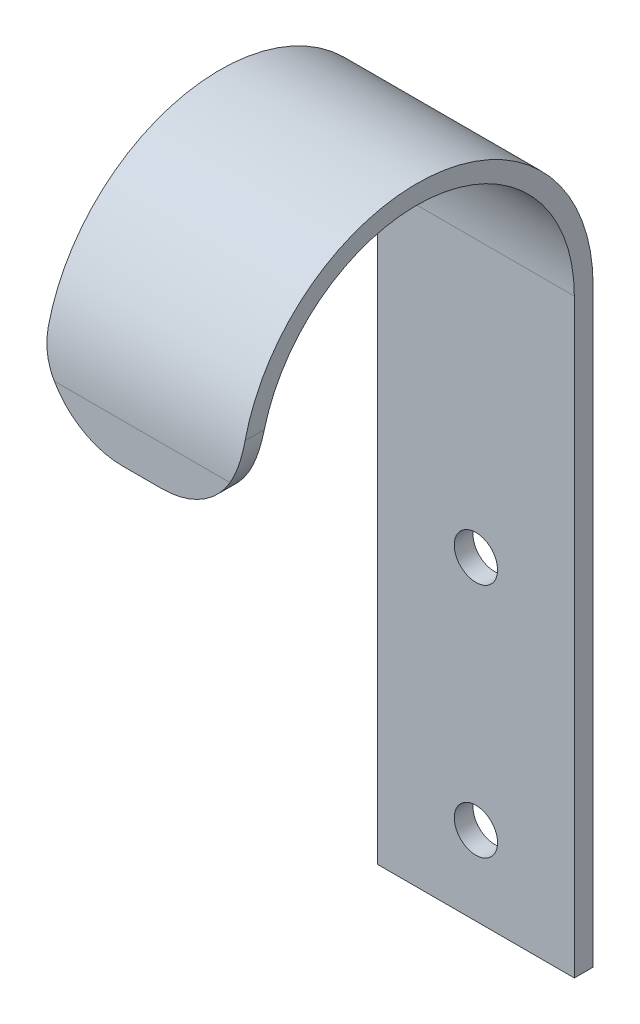
ISO-10303-21;
HEADER;
FILE_DESCRIPTION(('STEP AP214'),'2;1');
FILE_NAME('part.step','',(''),(''),'','','');
FILE_SCHEMA(('AUTOMOTIVE_DESIGN { 1 0 10303 214 1 1 1 1 }'));
ENDSEC;
DATA;
#1=APPLICATION_CONTEXT('core data for automotive mechanical design processes');
#2=APPLICATION_PROTOCOL_DEFINITION('international standard','automotive_design',2000,#1);
#3=PRODUCT_CONTEXT('',#1,'mechanical');
#4=PRODUCT('Part','Part','',(#3));
#5=PRODUCT_RELATED_PRODUCT_CATEGORY('part','',(#4));
#6=PRODUCT_DEFINITION_FORMATION('','',#4);
#7=PRODUCT_DEFINITION_CONTEXT('part definition',#1,'design');
#8=PRODUCT_DEFINITION('design','',#6,#7);
#9=PRODUCT_DEFINITION_SHAPE('','',#8);
#10=(LENGTH_UNIT() NAMED_UNIT(*) SI_UNIT(.MILLI.,.METRE.));
#11=(NAMED_UNIT(*) PLANE_ANGLE_UNIT() SI_UNIT($,.RADIAN.));
#12=(NAMED_UNIT(*) SI_UNIT($,.STERADIAN.) SOLID_ANGLE_UNIT());
#13=UNCERTAINTY_MEASURE_WITH_UNIT(LENGTH_MEASURE(1.E-05),#10,'distance_accuracy_value','');
#14=(GEOMETRIC_REPRESENTATION_CONTEXT(3) GLOBAL_UNCERTAINTY_ASSIGNED_CONTEXT((#13)) GLOBAL_UNIT_ASSIGNED_CONTEXT((#10,
#11,#12)) REPRESENTATION_CONTEXT('',''));
#15=CARTESIAN_POINT('',(0.,0.,0.));
#16=DIRECTION('',(0.,0.,1.));
#17=DIRECTION('',(1.,0.,0.));
#18=AXIS2_PLACEMENT_3D('',#15,#16,#17);
#19=CARTESIAN_POINT('',(25.,0.,0.));
#20=DIRECTION('',(0.,0.,1.));
#21=DIRECTION('',(1.,0.,0.));
#22=AXIS2_PLACEMENT_3D('',#19,#20,#21);
#23=PLANE('',#22);
#24=CARTESIAN_POINT('',(12.5,10.,0.));
#25=DIRECTION('',(0.,0.,1.));
#26=DIRECTION('',(1.,0.,0.));
#27=AXIS2_PLACEMENT_3D('',#24,#25,#26);
#28=CIRCLE('',#27,2.75);
#29=CARTESIAN_POINT('',(15.25,10.,0.));
#30=VERTEX_POINT('',#29);
#31=EDGE_CURVE('E246',#30,#30,#28,.T.);
#32=ORIENTED_EDGE('',*,*,#31,.F.);
#33=EDGE_LOOP('',(#32));
#34=FACE_BOUND('',#33,.T.);
#35=CARTESIAN_POINT('',(12.5,40.,0.));
#36=DIRECTION('',(0.,0.,1.));
#37=DIRECTION('',(1.,0.,0.));
#38=AXIS2_PLACEMENT_3D('',#35,#36,#37);
#39=CIRCLE('',#38,2.75);
#40=CARTESIAN_POINT('',(15.25,40.,0.));
#41=VERTEX_POINT('',#40);
#42=EDGE_CURVE('E141',#41,#41,#39,.T.);
#43=ORIENTED_EDGE('',*,*,#42,.F.);
#44=EDGE_LOOP('',(#43));
#45=FACE_BOUND('',#44,.T.);
#46=DIRECTION('',(0.,1.,0.));
#47=VECTOR('',#46,1.);
#48=CARTESIAN_POINT('',(0.,0.,0.));
#49=LINE('',#48,#47);
#50=CARTESIAN_POINT('',(0.,0.,0.));
#51=VERTEX_POINT('',#50);
#52=CARTESIAN_POINT('',(0.,75.,0.));
#53=VERTEX_POINT('',#52);
#54=EDGE_CURVE('E148',#51,#53,#49,.T.);
#55=ORIENTED_EDGE('',*,*,#54,.F.);
#56=DIRECTION('',(-1.,0.,0.));
#57=VECTOR('',#56,1.);
#58=CARTESIAN_POINT('',(25.,0.,0.));
#59=LINE('',#58,#57);
#60=CARTESIAN_POINT('',(25.,0.,0.));
#61=VERTEX_POINT('',#60);
#62=EDGE_CURVE('E134',#61,#51,#59,.T.);
#63=ORIENTED_EDGE('',*,*,#62,.F.);
#64=DIRECTION('',(0.,1.,0.));
#65=VECTOR('',#64,1.);
#66=CARTESIAN_POINT('',(25.,0.,0.));
#67=LINE('',#66,#65);
#68=CARTESIAN_POINT('',(25.,75.,0.));
#69=VERTEX_POINT('',#68);
#70=EDGE_CURVE('E130',#61,#69,#67,.T.);
#71=ORIENTED_EDGE('',*,*,#70,.T.);
#72=DIRECTION('',(-1.,0.,0.));
#73=VECTOR('',#72,1.);
#74=CARTESIAN_POINT('',(25.,75.,0.));
#75=LINE('',#74,#73);
#76=EDGE_CURVE('E114',#69,#53,#75,.T.);
#77=ORIENTED_EDGE('',*,*,#76,.T.);
#78=EDGE_LOOP('',(#55,#63,#71,#77));
#79=FACE_BOUND('',#78,.T.);
#80=ADVANCED_FACE('F33',(#34,#45,#79),#23,.T.);
#81=CARTESIAN_POINT('',(25.,0.,-2.38));
#82=DIRECTION('',(0.,-1.,0.));
#83=DIRECTION('',(0.,0.,-1.));
#84=AXIS2_PLACEMENT_3D('',#81,#82,#83);
#85=PLANE('',#84);
#86=DIRECTION('',(0.,0.,1.));
#87=VECTOR('',#86,1.);
#88=CARTESIAN_POINT('',(0.,0.,-2.38));
#89=LINE('',#88,#87);
#90=CARTESIAN_POINT('',(0.,0.,-2.38));
#91=VERTEX_POINT('',#90);
#92=EDGE_CURVE('E135',#91,#51,#89,.T.);
#93=ORIENTED_EDGE('',*,*,#92,.F.);
#94=DIRECTION('',(-1.,0.,0.));
#95=VECTOR('',#94,1.);
#96=CARTESIAN_POINT('',(25.,0.,-2.38));
#97=LINE('',#96,#95);
#98=CARTESIAN_POINT('',(25.,0.,-2.38));
#99=VERTEX_POINT('',#98);
#100=EDGE_CURVE('E157',#99,#91,#97,.T.);
#101=ORIENTED_EDGE('',*,*,#100,.F.);
#102=DIRECTION('',(0.,0.,1.));
#103=VECTOR('',#102,1.);
#104=CARTESIAN_POINT('',(25.,0.,-2.38));
#105=LINE('',#104,#103);
#106=EDGE_CURVE('E125',#99,#61,#105,.T.);
#107=ORIENTED_EDGE('',*,*,#106,.T.);
#108=ORIENTED_EDGE('',*,*,#62,.T.);
#109=EDGE_LOOP('',(#93,#101,#107,#108));
#110=FACE_BOUND('',#109,.T.);
#111=ADVANCED_FACE('F237',(#110),#85,.T.);
#112=CARTESIAN_POINT('',(25.,0.,-2.38));
#113=DIRECTION('',(0.,0.,1.));
#114=DIRECTION('',(1.,0.,0.));
#115=AXIS2_PLACEMENT_3D('',#112,#113,#114);
#116=PLANE('',#115);
#117=CARTESIAN_POINT('',(12.5,10.,-2.38));
#118=DIRECTION('',(0.,0.,1.));
#119=DIRECTION('',(1.,0.,0.));
#120=AXIS2_PLACEMENT_3D('',#117,#118,#119);
#121=CIRCLE('',#120,2.75);
#122=CARTESIAN_POINT('',(15.25,10.,-2.38));
#123=VERTEX_POINT('',#122);
#124=EDGE_CURVE('E38',#123,#123,#121,.T.);
#125=ORIENTED_EDGE('',*,*,#124,.T.);
#126=EDGE_LOOP('',(#125));
#127=FACE_BOUND('',#126,.T.);
#128=CARTESIAN_POINT('',(12.5,40.,-2.38));
#129=DIRECTION('',(0.,0.,1.));
#130=DIRECTION('',(1.,0.,0.));
#131=AXIS2_PLACEMENT_3D('',#128,#129,#130);
#132=CIRCLE('',#131,2.75);
#133=CARTESIAN_POINT('',(15.25,40.,-2.38));
#134=VERTEX_POINT('',#133);
#135=EDGE_CURVE('E250',#134,#134,#132,.T.);
#136=ORIENTED_EDGE('',*,*,#135,.T.);
#137=EDGE_LOOP('',(#136));
#138=FACE_BOUND('',#137,.T.);
#139=DIRECTION('',(0.,1.,0.));
#140=VECTOR('',#139,1.);
#141=CARTESIAN_POINT('',(0.,0.,-2.38));
#142=LINE('',#141,#140);
#143=CARTESIAN_POINT('',(0.,75.,-2.38));
#144=VERTEX_POINT('',#143);
#145=EDGE_CURVE('E138',#91,#144,#142,.T.);
#146=ORIENTED_EDGE('',*,*,#145,.T.);
#147=DIRECTION('',(-1.,0.,0.));
#148=VECTOR('',#147,1.);
#149=CARTESIAN_POINT('',(25.,75.,-2.38));
#150=LINE('',#149,#148);
#151=CARTESIAN_POINT('',(25.,75.,-2.38));
#152=VERTEX_POINT('',#151);
#153=EDGE_CURVE('E159',#152,#144,#150,.T.);
#154=ORIENTED_EDGE('',*,*,#153,.F.);
#155=DIRECTION('',(0.,1.,0.));
#156=VECTOR('',#155,1.);
#157=CARTESIAN_POINT('',(25.,0.,-2.38));
#158=LINE('',#157,#156);
#159=EDGE_CURVE('E145',#99,#152,#158,.T.);
#160=ORIENTED_EDGE('',*,*,#159,.F.);
#161=ORIENTED_EDGE('',*,*,#100,.T.);
#162=EDGE_LOOP('',(#146,#154,#160,#161));
#163=FACE_BOUND('',#162,.T.);
#164=ADVANCED_FACE('F192',(#127,#138,#163),#116,.F.);
#165=CARTESIAN_POINT('',(25.,75.,20.));
#166=DIRECTION('',(-1.,0.,0.));
#167=DIRECTION('',(0.,0.,1.));
#168=AXIS2_PLACEMENT_3D('',#165,#166,#167);
#169=CYLINDRICAL_SURFACE('',#168,22.38);
#170=CARTESIAN_POINT('',(0.,75.,20.));
#171=DIRECTION('',(1.,0.,0.));
#172=DIRECTION('',(0.,0.,-1.));
#173=AXIS2_PLACEMENT_3D('',#170,#171,#172);
#174=CIRCLE('',#173,22.38);
#175=CARTESIAN_POINT('',(0.,80.,41.8143164000158));
#176=VERTEX_POINT('',#175);
#177=EDGE_CURVE('E151',#144,#176,#174,.T.);
#178=ORIENTED_EDGE('',*,*,#177,.T.);
#179=CARTESIAN_POINT('',(0.,80.,41.8143164000158));
#180=CARTESIAN_POINT('',(-4.01566475522033E-05,79.7415645647285,41.8735955336258));
#181=CARTESIAN_POINT('',(0.0100177616976151,79.4820362665122,41.9282046548543));
#182=CARTESIAN_POINT('',(0.0505464556793609,78.9626822243309,42.0279590691738));
#183=CARTESIAN_POINT('',(0.081022953090203,78.7028564173763,42.0731017048722));
#184=CARTESIAN_POINT('',(0.161648503931644,78.1910197879649,42.1528194615875));
#185=CARTESIAN_POINT('',(0.211319109097416,77.9389686592262,42.1876177140144));
#186=CARTESIAN_POINT('',(0.330196163996655,77.4385458497145,42.2481779657935));
#187=CARTESIAN_POINT('',(0.399395784134708,77.1901729145233,42.2739431171087));
#188=CARTESIAN_POINT('',(0.585633263696083,76.6098678741651,42.3245448607413));
#189=CARTESIAN_POINT('',(0.710921278015272,76.2801960812729,42.3456768943747));
#190=CARTESIAN_POINT('',(0.925686114805509,75.7941722865472,42.3665082800431));
#191=CARTESIAN_POINT('',(1.00248557531248,75.6322946623453,42.3716369758206));
#192=CARTESIAN_POINT('',(1.16470612958317,75.3128200095522,42.3783837867991));
#193=CARTESIAN_POINT('',(1.25012817022563,75.1552234534986,42.3800015160077));
#194=CARTESIAN_POINT('',(1.33974596215559,75.,42.38));
#195=B_SPLINE_CURVE_WITH_KNOTS('',3,(#179,#180,#181,#182,#183,#184,#185,#186,#187,#188,#189,
#190,#191,#192,#193,#194),.UNSPECIFIED.,.F.,.F.,(4,2,2,2,2,2,2,4),(0.,0.795237205347192,
1.59069734843976,2.36749008975154,3.14401151067256,4.20131834274524,4.73880813094585,
5.27635700731653),.UNSPECIFIED.);
#196=CARTESIAN_POINT('',(1.33974596215558,75.,42.38));
#197=VERTEX_POINT('',#196);
#198=EDGE_CURVE('E180',#176,#197,#195,.T.);
#199=ORIENTED_EDGE('',*,*,#198,.T.);
#200=DIRECTION('',(-1.,0.,0.));
#201=VECTOR('',#200,1.);
#202=CARTESIAN_POINT('',(25.,75.,42.38));
#203=LINE('',#202,#201);
#204=CARTESIAN_POINT('',(23.6602540378444,75.,42.38));
#205=VERTEX_POINT('',#204);
#206=EDGE_CURVE('E162',#205,#197,#203,.T.);
#207=ORIENTED_EDGE('',*,*,#206,.F.);
#208=CARTESIAN_POINT('',(23.6602540378444,75.,42.38));
#209=CARTESIAN_POINT('',(23.7928630406756,75.2296083789577,42.3800301461021));
#210=CARTESIAN_POINT('',(23.9162816859567,75.4645421050732,42.3764676862775));
#211=CARTESIAN_POINT('',(24.1440375643065,75.9433179712805,42.3613857476998));
#212=CARTESIAN_POINT('',(24.2483692801286,76.1871626628056,42.3498639728181));
#213=CARTESIAN_POINT('',(24.4349565343535,76.6760752234138,42.3184637285898));
#214=CARTESIAN_POINT('',(24.5176729237918,76.9209799222721,42.2987878376667));
#215=CARTESIAN_POINT('',(24.6636954253501,77.4155310261661,42.2506484413278));
#216=CARTESIAN_POINT('',(24.7270083928001,77.665175723355,42.2221880466724));
#217=CARTESIAN_POINT('',(24.8533772755009,78.2584251694048,42.1442045924404));
#218=CARTESIAN_POINT('',(24.908062119715,78.6033643264317,42.0907866031371));
#219=CARTESIAN_POINT('',(24.9631221136977,79.1239761281432,41.9974801475468));
#220=CARTESIAN_POINT('',(24.9769802146006,79.2994915615997,41.9638517273388));
#221=CARTESIAN_POINT('',(24.9954195420408,79.650152328971,41.8922935003689));
#222=CARTESIAN_POINT('',(24.999999820446,79.8252976232332,41.854363254407));
#223=CARTESIAN_POINT('',(25.,80.,41.8143164000158));
#224=B_SPLINE_CURVE_WITH_KNOTS('',3,(#208,#209,#210,#211,#212,#213,#214,#215,#216,#217,#218,
#219,#220,#221,#222,#223),.UNSPECIFIED.,.F.,.F.,(4,2,2,2,2,2,2,4),(0.,0.79524175910654,
1.59071302794997,2.36750563340956,3.14402347677191,4.20132446805088,4.73881279403285,
5.27635604499626),.UNSPECIFIED.);
#225=CARTESIAN_POINT('',(25.,80.,41.8143164000158));
#226=VERTEX_POINT('',#225);
#227=EDGE_CURVE('E173',#205,#226,#224,.T.);
#228=ORIENTED_EDGE('',*,*,#227,.T.);
#229=CARTESIAN_POINT('',(25.,75.,20.));
#230=DIRECTION('',(1.,0.,0.));
#231=DIRECTION('',(0.,0.,-1.));
#232=AXIS2_PLACEMENT_3D('',#229,#230,#231);
#233=CIRCLE('',#232,22.38);
#234=EDGE_CURVE('E132',#152,#226,#233,.T.);
#235=ORIENTED_EDGE('',*,*,#234,.F.);
#236=ORIENTED_EDGE('',*,*,#153,.T.);
#237=EDGE_LOOP('',(#178,#199,#207,#228,#235,#236));
#238=FACE_BOUND('',#237,.T.);
#239=ADVANCED_FACE('F186',(#238),#169,.T.);
#240=CARTESIAN_POINT('',(25.,75.,42.38));
#241=DIRECTION('',(0.,0.,-1.));
#242=DIRECTION('',(-1.,0.,0.));
#243=AXIS2_PLACEMENT_3D('',#240,#241,#242);
#244=PLANE('',#243);
#245=ORIENTED_EDGE('',*,*,#206,.T.);
#246=CARTESIAN_POINT('',(10.,80.,42.38));
#247=DIRECTION('',(0.,0.,-1.));
#248=DIRECTION('',(-1.,0.,0.));
#249=AXIS2_PLACEMENT_3D('',#246,#247,#248);
#250=CIRCLE('',#249,10.);
#251=CARTESIAN_POINT('',(10.,70.,42.38));
#252=VERTEX_POINT('',#251);
#253=EDGE_CURVE('E359',#197,#252,#250,.F.);
#254=ORIENTED_EDGE('',*,*,#253,.T.);
#255=DIRECTION('',(-1.,0.,0.));
#256=VECTOR('',#255,1.);
#257=CARTESIAN_POINT('',(25.,70.,42.38));
#258=LINE('',#257,#256);
#259=CARTESIAN_POINT('',(15.,70.,42.38));
#260=VERTEX_POINT('',#259);
#261=EDGE_CURVE('E165',#260,#252,#258,.T.);
#262=ORIENTED_EDGE('',*,*,#261,.F.);
#263=CARTESIAN_POINT('',(15.,80.,42.38));
#264=DIRECTION('',(0.,0.,-1.));
#265=DIRECTION('',(-1.,0.,0.));
#266=AXIS2_PLACEMENT_3D('',#263,#264,#265);
#267=CIRCLE('',#266,10.);
#268=EDGE_CURVE('E361',#260,#205,#267,.F.);
#269=ORIENTED_EDGE('',*,*,#268,.T.);
#270=EDGE_LOOP('',(#245,#254,#262,#269));
#271=FACE_BOUND('',#270,.T.);
#272=ADVANCED_FACE('F191',(#271),#244,.F.);
#273=CARTESIAN_POINT('',(25.,70.,40.));
#274=DIRECTION('',(0.,-1.,0.));
#275=DIRECTION('',(0.,0.,-1.));
#276=AXIS2_PLACEMENT_3D('',#273,#274,#275);
#277=PLANE('',#276);
#278=ORIENTED_EDGE('',*,*,#261,.T.);
#279=DIRECTION('',(0.,0.,1.));
#280=VECTOR('',#279,1.);
#281=CARTESIAN_POINT('',(10.,70.,40.));
#282=LINE('',#281,#280);
#283=CARTESIAN_POINT('',(10.,70.,40.));
#284=VERTEX_POINT('',#283);
#285=EDGE_CURVE('E368',#252,#284,#282,.F.);
#286=ORIENTED_EDGE('',*,*,#285,.T.);
#287=DIRECTION('',(-1.,0.,0.));
#288=VECTOR('',#287,1.);
#289=CARTESIAN_POINT('',(25.,70.,40.));
#290=LINE('',#289,#288);
#291=CARTESIAN_POINT('',(15.,70.,40.));
#292=VERTEX_POINT('',#291);
#293=EDGE_CURVE('E168',#292,#284,#290,.T.);
#294=ORIENTED_EDGE('',*,*,#293,.F.);
#295=DIRECTION('',(0.,0.,1.));
#296=VECTOR('',#295,1.);
#297=CARTESIAN_POINT('',(15.,70.,40.));
#298=LINE('',#297,#296);
#299=EDGE_CURVE('E363',#292,#260,#298,.T.);
#300=ORIENTED_EDGE('',*,*,#299,.T.);
#301=EDGE_LOOP('',(#278,#286,#294,#300));
#302=FACE_BOUND('',#301,.T.);
#303=ADVANCED_FACE('F198',(#302),#277,.T.);
#304=CARTESIAN_POINT('',(25.,75.,40.));
#305=DIRECTION('',(0.,0.,-1.));
#306=DIRECTION('',(-1.,0.,0.));
#307=AXIS2_PLACEMENT_3D('',#304,#305,#306);
#308=PLANE('',#307);
#309=ORIENTED_EDGE('',*,*,#293,.T.);
#310=CARTESIAN_POINT('',(10.,80.,40.));
#311=DIRECTION('',(0.,0.,-1.));
#312=DIRECTION('',(-1.,0.,0.));
#313=AXIS2_PLACEMENT_3D('',#310,#311,#312);
#314=CIRCLE('',#313,10.);
#315=CARTESIAN_POINT('',(1.33974596215558,75.,40.));
#316=VERTEX_POINT('',#315);
#317=EDGE_CURVE('E57',#284,#316,#314,.T.);
#318=ORIENTED_EDGE('',*,*,#317,.T.);
#319=DIRECTION('',(-1.,0.,0.));
#320=VECTOR('',#319,1.);
#321=CARTESIAN_POINT('',(25.,75.,40.));
#322=LINE('',#321,#320);
#323=CARTESIAN_POINT('',(23.6602540378444,75.,40.));
#324=VERTEX_POINT('',#323);
#325=EDGE_CURVE('E124',#324,#316,#322,.T.);
#326=ORIENTED_EDGE('',*,*,#325,.F.);
#327=CARTESIAN_POINT('',(15.,80.,40.));
#328=DIRECTION('',(0.,0.,-1.));
#329=DIRECTION('',(-1.,0.,0.));
#330=AXIS2_PLACEMENT_3D('',#327,#328,#329);
#331=CIRCLE('',#330,10.);
#332=EDGE_CURVE('E370',#324,#292,#331,.T.);
#333=ORIENTED_EDGE('',*,*,#332,.T.);
#334=EDGE_LOOP('',(#309,#318,#326,#333));
#335=FACE_BOUND('',#334,.T.);
#336=ADVANCED_FACE('F202',(#335),#308,.T.);
#337=CARTESIAN_POINT('',(25.,75.,20.));
#338=DIRECTION('',(-1.,0.,0.));
#339=DIRECTION('',(0.,0.,1.));
#340=AXIS2_PLACEMENT_3D('',#337,#338,#339);
#341=CYLINDRICAL_SURFACE('',#340,20.);
#342=ORIENTED_EDGE('',*,*,#325,.T.);
#343=CARTESIAN_POINT('',(1.33974596215558,75.,40.));
#344=CARTESIAN_POINT('',(1.20924609728789,75.2259532711324,40.0000317848471));
#345=CARTESIAN_POINT('',(1.08764808072299,75.4570696075061,39.9961720274278));
#346=CARTESIAN_POINT('',(0.862937237221113,75.9279069148646,39.9798437810755));
#347=CARTESIAN_POINT('',(0.759829819324366,76.1676303791518,39.9673727782596));
#348=CARTESIAN_POINT('',(0.575098833680739,76.6480012479344,39.9334072889523));
#349=CARTESIAN_POINT('',(0.493019671039465,76.8884888685452,39.9121361842284));
#350=CARTESIAN_POINT('',(0.347641697735003,77.3739381958301,39.8601118726252));
#351=CARTESIAN_POINT('',(0.284336469315047,77.6188983431294,39.8293619133833));
#352=CARTESIAN_POINT('',(0.153877451739354,78.2160324130976,39.7429073709505));
#353=CARTESIAN_POINT('',(0.0964445342294561,78.5696836582643,39.6821495089399));
#354=CARTESIAN_POINT('',(0.0386534026841779,79.1030987094631,39.5754541162841));
#355=CARTESIAN_POINT('',(0.0241174520941748,79.2829717264422,39.5368901945663));
#356=CARTESIAN_POINT('',(0.00479045525430247,79.6420954274853,39.4546880794487));
#357=CARTESIAN_POINT('',(8.46670343348587E-08,79.8213460675397,39.4110495344461));
#358=CARTESIAN_POINT('',(0.,80.,39.3649167310371));
#359=B_SPLINE_CURVE_WITH_KNOTS('',3,(#343,#344,#345,#346,#347,#348,#349,#350,#351,#352,#353,
#354,#355,#356,#357,#358),.UNSPECIFIED.,.F.,.F.,(4,2,2,2,2,2,2,4),(0.,0.782592117861758,
1.56541279466614,2.32947548309952,3.09327667941647,4.18049860027143,4.73382606081678,
5.2871918823352),.UNSPECIFIED.);
#360=CARTESIAN_POINT('',(0.,80.,39.3649167310371));
#361=VERTEX_POINT('',#360);
#362=EDGE_CURVE('E43',#316,#361,#359,.T.);
#363=ORIENTED_EDGE('',*,*,#362,.T.);
#364=CARTESIAN_POINT('',(0.,75.,20.));
#365=DIRECTION('',(1.,0.,0.));
#366=DIRECTION('',(0.,0.,-1.));
#367=AXIS2_PLACEMENT_3D('',#364,#365,#366);
#368=CIRCLE('',#367,20.);
#369=EDGE_CURVE('E119',#53,#361,#368,.T.);
#370=ORIENTED_EDGE('',*,*,#369,.F.);
#371=ORIENTED_EDGE('',*,*,#76,.F.);
#372=CARTESIAN_POINT('',(25.,75.,20.));
#373=DIRECTION('',(1.,0.,0.));
#374=DIRECTION('',(0.,0.,-1.));
#375=AXIS2_PLACEMENT_3D('',#372,#373,#374);
#376=CIRCLE('',#375,20.);
#377=CARTESIAN_POINT('',(25.,80.,39.3649167310371));
#378=VERTEX_POINT('',#377);
#379=EDGE_CURVE('E116',#69,#378,#376,.T.);
#380=ORIENTED_EDGE('',*,*,#379,.T.);
#381=CARTESIAN_POINT('',(25.,80.,39.3649167310371));
#382=CARTESIAN_POINT('',(25.0000409916937,79.7473706532261,39.4301917341102));
#383=CARTESIAN_POINT('',(24.990427208888,79.4934172255909,39.4904436201765));
#384=CARTESIAN_POINT('',(24.9515873675342,78.9847238656968,39.6007462232392));
#385=CARTESIAN_POINT('',(24.9223557442033,78.729983730695,39.6507940405035));
#386=CARTESIAN_POINT('',(24.844915590278,78.2278097792307,39.7394222887347));
#387=CARTESIAN_POINT('',(24.7971782582433,77.9803470802349,39.7782486268052));
#388=CARTESIAN_POINT('',(24.6828002737634,77.4886004625696,39.8461202988745));
#389=CARTESIAN_POINT('',(24.6161660088998,77.2443154988879,39.8751689307106));
#390=CARTESIAN_POINT('',(24.4319521844182,76.6580956093381,39.9341469082631));
#391=CARTESIAN_POINT('',(24.3047479647688,76.3186123552508,39.9592407378605));
#392=CARTESIAN_POINT('',(24.0854516911009,75.8180565994933,39.9839810805314));
#393=CARTESIAN_POINT('',(24.0067918578145,75.6512373440737,39.9900726321429));
#394=CARTESIAN_POINT('',(23.8403226457993,75.3221074675109,39.9980831127296));
#395=CARTESIAN_POINT('',(23.7525125538743,75.1597971990612,40.0000017161984));
#396=CARTESIAN_POINT('',(23.6602540378444,75.,40.));
#397=B_SPLINE_CURVE_WITH_KNOTS('',3,(#381,#382,#383,#384,#385,#386,#387,#388,#389,#390,#391,
#392,#393,#394,#395,#396),.UNSPECIFIED.,.F.,.F.,(4,2,2,2,2,2,2,4),(0.,0.782586046308297,
1.56539417429922,2.32945657162781,3.09326100616899,4.18049028402403,4.73382009261072,
5.28719306154356),.UNSPECIFIED.);
#398=EDGE_CURVE('E211',#378,#324,#397,.T.);
#399=ORIENTED_EDGE('',*,*,#398,.T.);
#400=EDGE_LOOP('',(#342,#363,#370,#371,#380,#399));
#401=FACE_BOUND('',#400,.T.);
#402=ADVANCED_FACE('F115',(#401),#341,.F.);
#403=CARTESIAN_POINT('',(25.,75.,20.));
#404=DIRECTION('',(1.,0.,0.));
#405=DIRECTION('',(0.,0.,-1.));
#406=AXIS2_PLACEMENT_3D('',#403,#404,#405);
#407=PLANE('',#406);
#408=ORIENTED_EDGE('',*,*,#234,.T.);
#409=DIRECTION('',(0.,0.,1.));
#410=VECTOR('',#409,1.);
#411=CARTESIAN_POINT('',(25.,80.,20.));
#412=LINE('',#411,#410);
#413=EDGE_CURVE('E11',#226,#378,#412,.F.);
#414=ORIENTED_EDGE('',*,*,#413,.T.);
#415=ORIENTED_EDGE('',*,*,#379,.F.);
#416=ORIENTED_EDGE('',*,*,#70,.F.);
#417=ORIENTED_EDGE('',*,*,#106,.F.);
#418=ORIENTED_EDGE('',*,*,#159,.T.);
#419=EDGE_LOOP('',(#408,#414,#415,#416,#417,#418));
#420=FACE_BOUND('',#419,.T.);
#421=ADVANCED_FACE('F128',(#420),#407,.T.);
#422=CARTESIAN_POINT('',(0.,75.,20.));
#423=DIRECTION('',(1.,0.,0.));
#424=DIRECTION('',(0.,0.,-1.));
#425=AXIS2_PLACEMENT_3D('',#422,#423,#424);
#426=PLANE('',#425);
#427=ORIENTED_EDGE('',*,*,#369,.T.);
#428=DIRECTION('',(0.,0.,1.));
#429=VECTOR('',#428,1.);
#430=CARTESIAN_POINT('',(0.,80.,42.38));
#431=LINE('',#430,#429);
#432=EDGE_CURVE('E156',#361,#176,#431,.T.);
#433=ORIENTED_EDGE('',*,*,#432,.T.);
#434=ORIENTED_EDGE('',*,*,#177,.F.);
#435=ORIENTED_EDGE('',*,*,#145,.F.);
#436=ORIENTED_EDGE('',*,*,#92,.T.);
#437=ORIENTED_EDGE('',*,*,#54,.T.);
#438=EDGE_LOOP('',(#427,#433,#434,#435,#436,#437));
#439=FACE_BOUND('',#438,.T.);
#440=ADVANCED_FACE('F225',(#439),#426,.F.);
#441=CARTESIAN_POINT('',(10.,80.,20.));
#442=DIRECTION('',(0.,0.,-1.));
#443=DIRECTION('',(-1.,0.,0.));
#444=AXIS2_PLACEMENT_3D('',#441,#442,#443);
#445=CYLINDRICAL_SURFACE('',#444,10.);
#446=ORIENTED_EDGE('',*,*,#317,.F.);
#447=ORIENTED_EDGE('',*,*,#285,.F.);
#448=ORIENTED_EDGE('',*,*,#253,.F.);
#449=ORIENTED_EDGE('',*,*,#198,.F.);
#450=ORIENTED_EDGE('',*,*,#432,.F.);
#451=ORIENTED_EDGE('',*,*,#362,.F.);
#452=EDGE_LOOP('',(#446,#447,#448,#449,#450,#451));
#453=FACE_BOUND('',#452,.T.);
#454=ADVANCED_FACE('F222',(#453),#445,.T.);
#455=CARTESIAN_POINT('',(15.,80.,40.));
#456=DIRECTION('',(0.,0.,1.));
#457=DIRECTION('',(1.,0.,0.));
#458=AXIS2_PLACEMENT_3D('',#455,#456,#457);
#459=CYLINDRICAL_SURFACE('',#458,10.);
#460=ORIENTED_EDGE('',*,*,#398,.F.);
#461=ORIENTED_EDGE('',*,*,#413,.F.);
#462=ORIENTED_EDGE('',*,*,#227,.F.);
#463=ORIENTED_EDGE('',*,*,#268,.F.);
#464=ORIENTED_EDGE('',*,*,#299,.F.);
#465=ORIENTED_EDGE('',*,*,#332,.F.);
#466=EDGE_LOOP('',(#460,#461,#462,#463,#464,#465));
#467=FACE_BOUND('',#466,.T.);
#468=ADVANCED_FACE('F35',(#467),#459,.T.);
#469=CARTESIAN_POINT('',(12.5,40.,-25.));
#470=DIRECTION('',(0.,0.,1.));
#471=DIRECTION('',(1.,0.,0.));
#472=AXIS2_PLACEMENT_3D('',#469,#470,#471);
#473=CYLINDRICAL_SURFACE('',#472,2.75);
#474=ORIENTED_EDGE('',*,*,#42,.T.);
#475=EDGE_LOOP('',(#474));
#476=FACE_BOUND('',#475,.T.);
#477=ORIENTED_EDGE('',*,*,#135,.F.);
#478=EDGE_LOOP('',(#477));
#479=FACE_BOUND('',#478,.T.);
#480=ADVANCED_FACE('F232',(#476,#479),#473,.F.);
#481=CARTESIAN_POINT('',(12.5,10.,-25.));
#482=DIRECTION('',(0.,0.,1.));
#483=DIRECTION('',(1.,0.,0.));
#484=AXIS2_PLACEMENT_3D('',#481,#482,#483);
#485=CYLINDRICAL_SURFACE('',#484,2.75);
#486=ORIENTED_EDGE('',*,*,#31,.T.);
#487=EDGE_LOOP('',(#486));
#488=FACE_BOUND('',#487,.T.);
#489=ORIENTED_EDGE('',*,*,#124,.F.);
#490=EDGE_LOOP('',(#489));
#491=FACE_BOUND('',#490,.T.);
#492=ADVANCED_FACE('F259',(#488,#491),#485,.F.);
#493=CLOSED_SHELL('',(#80,#111,#164,#239,#272,#303,#336,#402,#421,#440,#454,#468,#480,#492));
#494=MANIFOLD_SOLID_BREP('B2',#493);
#495=ADVANCED_BREP_SHAPE_REPRESENTATION('',(#18,#494),#14);
#496=SHAPE_DEFINITION_REPRESENTATION(#9,#495);
ENDSEC;
END-ISO-10303-21;
